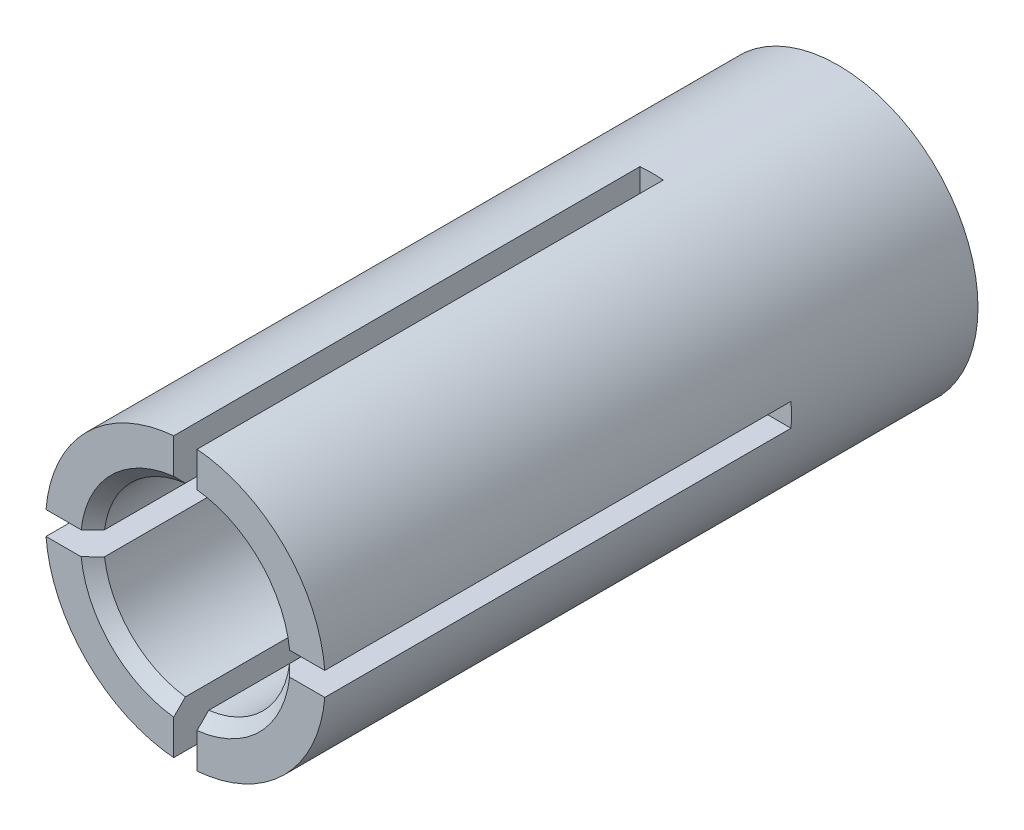
ISO-10303-21;
HEADER;
FILE_DESCRIPTION(('STEP AP214'),'2;1');
FILE_NAME('part.step','',(''),(''),'','','');
FILE_SCHEMA(('AUTOMOTIVE_DESIGN { 1 0 10303 214 1 1 1 1 }'));
ENDSEC;
DATA;
#1=APPLICATION_CONTEXT('core data for automotive mechanical design processes');
#2=APPLICATION_PROTOCOL_DEFINITION('international standard','automotive_design',2000,#1);
#3=PRODUCT_CONTEXT('',#1,'mechanical');
#4=PRODUCT('Part','Part','',(#3));
#5=PRODUCT_RELATED_PRODUCT_CATEGORY('part','',(#4));
#6=PRODUCT_DEFINITION_FORMATION('','',#4);
#7=PRODUCT_DEFINITION_CONTEXT('part definition',#1,'design');
#8=PRODUCT_DEFINITION('design','',#6,#7);
#9=PRODUCT_DEFINITION_SHAPE('','',#8);
#10=(LENGTH_UNIT() NAMED_UNIT(*) SI_UNIT(.MILLI.,.METRE.));
#11=(NAMED_UNIT(*) PLANE_ANGLE_UNIT() SI_UNIT($,.RADIAN.));
#12=(NAMED_UNIT(*) SI_UNIT($,.STERADIAN.) SOLID_ANGLE_UNIT());
#13=UNCERTAINTY_MEASURE_WITH_UNIT(LENGTH_MEASURE(1.E-05),#10,'distance_accuracy_value','');
#14=(GEOMETRIC_REPRESENTATION_CONTEXT(3) GLOBAL_UNCERTAINTY_ASSIGNED_CONTEXT((#13)) GLOBAL_UNIT_ASSIGNED_CONTEXT((#10,
#11,#12)) REPRESENTATION_CONTEXT('',''));
#15=CARTESIAN_POINT('',(0.,0.,0.));
#16=DIRECTION('',(0.,0.,1.));
#17=DIRECTION('',(1.,0.,0.));
#18=AXIS2_PLACEMENT_3D('',#15,#16,#17);
#19=CARTESIAN_POINT('',(0.,0.,14.));
#20=DIRECTION('',(0.,0.,1.));
#21=DIRECTION('',(1.,0.,0.));
#22=AXIS2_PLACEMENT_3D('',#19,#20,#21);
#23=PLANE('',#22);
#24=DIRECTION('',(1.,0.,0.));
#25=VECTOR('',#24,1.);
#26=CARTESIAN_POINT('',(2.98956518577535,-0.25,14.));
#27=LINE('',#26,#25);
#28=CARTESIAN_POINT('',(2.23606797749979,-0.25,14.));
#29=VERTEX_POINT('',#28);
#30=CARTESIAN_POINT('',(2.98956518577535,-0.25,14.));
#31=VERTEX_POINT('',#30);
#32=EDGE_CURVE('E189',#29,#31,#27,.T.);
#33=ORIENTED_EDGE('',*,*,#32,.F.);
#34=CARTESIAN_POINT('',(0.,0.,14.));
#35=DIRECTION('',(0.,0.,1.));
#36=DIRECTION('',(1.,0.,0.));
#37=AXIS2_PLACEMENT_3D('',#34,#35,#36);
#38=CIRCLE('',#37,2.25);
#39=CARTESIAN_POINT('',(0.25,-2.23606797749979,14.));
#40=VERTEX_POINT('',#39);
#41=EDGE_CURVE('E235',#29,#40,#38,.F.);
#42=ORIENTED_EDGE('',*,*,#41,.T.);
#43=DIRECTION('',(0.,1.,0.));
#44=VECTOR('',#43,1.);
#45=CARTESIAN_POINT('',(0.25,-0.25,14.));
#46=LINE('',#45,#44);
#47=CARTESIAN_POINT('',(0.250000000000002,-2.98956518577535,14.));
#48=VERTEX_POINT('',#47);
#49=EDGE_CURVE('E287',#48,#40,#46,.T.);
#50=ORIENTED_EDGE('',*,*,#49,.F.);
#51=CARTESIAN_POINT('',(0.,0.,14.));
#52=DIRECTION('',(0.,0.,1.));
#53=DIRECTION('',(1.,0.,0.));
#54=AXIS2_PLACEMENT_3D('',#51,#52,#53);
#55=CIRCLE('',#54,3.);
#56=EDGE_CURVE('E227',#48,#31,#55,.T.);
#57=ORIENTED_EDGE('',*,*,#56,.T.);
#58=EDGE_LOOP('',(#33,#42,#50,#57));
#59=FACE_BOUND('',#58,.T.);
#60=ADVANCED_FACE('F30',(#59),#23,.T.);
#61=DIRECTION('',(0.,-1.,0.));
#62=VECTOR('',#61,1.);
#63=CARTESIAN_POINT('',(-0.25,-0.25,14.));
#64=LINE('',#63,#62);
#65=CARTESIAN_POINT('',(-0.25,-2.23606797749979,14.));
#66=VERTEX_POINT('',#65);
#67=CARTESIAN_POINT('',(-0.25,-2.98956518577535,14.));
#68=VERTEX_POINT('',#67);
#69=EDGE_CURVE('E394',#66,#68,#64,.T.);
#70=ORIENTED_EDGE('',*,*,#69,.F.);
#71=CARTESIAN_POINT('',(-2.23606797749979,-0.25,14.));
#72=VERTEX_POINT('',#71);
#73=EDGE_CURVE('E239',#66,#72,#38,.F.);
#74=ORIENTED_EDGE('',*,*,#73,.T.);
#75=DIRECTION('',(1.,0.,0.));
#76=VECTOR('',#75,1.);
#77=CARTESIAN_POINT('',(-2.98956518577535,-0.25,14.));
#78=LINE('',#77,#76);
#79=CARTESIAN_POINT('',(-2.98956518577535,-0.249999999999999,14.));
#80=VERTEX_POINT('',#79);
#81=EDGE_CURVE('E392',#80,#72,#78,.T.);
#82=ORIENTED_EDGE('',*,*,#81,.F.);
#83=EDGE_CURVE('E434',#80,#68,#55,.T.);
#84=ORIENTED_EDGE('',*,*,#83,.T.);
#85=EDGE_LOOP('',(#70,#74,#82,#84));
#86=FACE_BOUND('',#85,.T.);
#87=ADVANCED_FACE('F275',(#86),#23,.T.);
#88=DIRECTION('',(-1.,0.,0.));
#89=VECTOR('',#88,1.);
#90=CARTESIAN_POINT('',(-2.98956518577535,0.249999999999998,14.));
#91=LINE('',#90,#89);
#92=CARTESIAN_POINT('',(-2.23606797749979,0.249999999999999,14.));
#93=VERTEX_POINT('',#92);
#94=CARTESIAN_POINT('',(-2.98956518577535,0.249999999999998,14.));
#95=VERTEX_POINT('',#94);
#96=EDGE_CURVE('E412',#93,#95,#91,.T.);
#97=ORIENTED_EDGE('',*,*,#96,.F.);
#98=CARTESIAN_POINT('',(-0.25,2.23606797749979,14.));
#99=VERTEX_POINT('',#98);
#100=EDGE_CURVE('E381',#93,#99,#38,.F.);
#101=ORIENTED_EDGE('',*,*,#100,.T.);
#102=DIRECTION('',(0.,-1.,0.));
#103=VECTOR('',#102,1.);
#104=CARTESIAN_POINT('',(-0.25,0.25,14.));
#105=LINE('',#104,#103);
#106=CARTESIAN_POINT('',(-0.25,2.98956518577535,14.));
#107=VERTEX_POINT('',#106);
#108=EDGE_CURVE('E415',#107,#99,#105,.T.);
#109=ORIENTED_EDGE('',*,*,#108,.F.);
#110=EDGE_CURVE('E226',#107,#95,#55,.T.);
#111=ORIENTED_EDGE('',*,*,#110,.T.);
#112=EDGE_LOOP('',(#97,#101,#109,#111));
#113=FACE_BOUND('',#112,.T.);
#114=ADVANCED_FACE('F268',(#113),#23,.T.);
#115=CARTESIAN_POINT('',(0.,0.,13.75));
#116=DIRECTION('',(0.,0.,1.));
#117=DIRECTION('',(1.,0.,0.));
#118=AXIS2_PLACEMENT_3D('',#115,#116,#117);
#119=CONICAL_SURFACE('',#118,2.,0.785398163397455);
#120=CARTESIAN_POINT('',(0.302741084224424,-0.25,12.1426221645264));
#121=CARTESIAN_POINT('',(0.317960453729847,-0.25,12.1543679730482));
#122=CARTESIAN_POINT('',(0.333014531848367,-0.25,12.1663229463904));
#123=CARTESIAN_POINT('',(0.36285792672978,-0.25,12.190554220147));
#124=CARTESIAN_POINT('',(0.377647290102898,-0.25,12.2028304630369));
#125=CARTESIAN_POINT('',(0.421711584192529,-0.25,12.2399907180696));
#126=CARTESIAN_POINT('',(0.450696505860515,-0.25,12.2652171671053));
#127=CARTESIAN_POINT('',(0.508176291730957,-0.25,12.3161879557759));
#128=CARTESIAN_POINT('',(0.536671402315201,-0.25,12.3419320200088));
#129=CARTESIAN_POINT('',(0.593351685196753,-0.25,12.3937670443241));
#130=CARTESIAN_POINT('',(0.621536809723744,-0.25,12.4198580565411));
#131=CARTESIAN_POINT('',(0.70945296388415,-0.25,12.5018997394878));
#132=CARTESIAN_POINT('',(0.768811177280418,-0.25,12.5582489591398));
#133=CARTESIAN_POINT('',(0.887045822918402,-0.25,12.6714511318724));
#134=CARTESIAN_POINT('',(0.945922240026668,-0.25,12.72830410066));
#135=CARTESIAN_POINT('',(1.12213731279967,-0.25,12.8992872007103));
#136=CARTESIAN_POINT('',(1.23906296186066,-0.25,13.013842641041));
#137=CARTESIAN_POINT('',(1.47257646545155,-0.25,13.2435090676362));
#138=CARTESIAN_POINT('',(1.58916391117353,-0.25,13.3586204674635));
#139=CARTESIAN_POINT('',(1.82209400881993,-0.25,13.5890861029974));
#140=CARTESIAN_POINT('',(1.9384366657381,-0.25,13.7044403336521));
#141=CARTESIAN_POINT('',(2.19822193413989,-0.25,13.9623251721432));
#142=CARTESIAN_POINT('',(2.34162858752974,-0.25,14.104891962737));
#143=CARTESIAN_POINT('',(2.62832290392371,-0.25,14.3901473591601));
#144=CARTESIAN_POINT('',(2.77161056599507,-0.25,14.5328359659267));
#145=CARTESIAN_POINT('',(3.05792402957366,-0.25,14.8181018736583));
#146=CARTESIAN_POINT('',(3.20094992869957,-0.25,14.9606790766729));
#147=CARTESIAN_POINT('',(3.48694883303794,-0.25,15.2458841152313));
#148=CARTESIAN_POINT('',(3.6299218386862,-0.25,15.3885119503382));
#149=CARTESIAN_POINT('',(3.77288046266891,-0.25,15.5311541869631));
#150=B_SPLINE_CURVE_WITH_KNOTS('',3,(#120,#121,#122,#123,#124,#125,#126,#127,#128,#129,#130,
#131,#132,#133,#134,#135,#136,#137,#138,#139,#140,#141,#142,#143,#144,#145,#146,#147,#148,#149),
.UNSPECIFIED.,.F.,.F.,(4,2,2,2,2,2,2,2,2,2,2,2,2,2,4),(0.,0.057668137817235,0.115326019670359,
0.23058906804333,0.345792332639199,0.461013108618342,0.706541151172433,0.952076876502175,
1.44314347376522,1.93466102702139,2.42616845403975,3.03281229507879,3.63946084754578,
4.24531725391537,4.85116855206024),.UNSPECIFIED.);
#151=CARTESIAN_POINT('',(1.98431348329844,-0.25,13.75));
#152=VERTEX_POINT('',#151);
#153=EDGE_CURVE('E294',#152,#29,#150,.T.);
#154=ORIENTED_EDGE('',*,*,#153,.F.);
#155=CARTESIAN_POINT('',(0.,0.,13.75));
#156=DIRECTION('',(0.,0.,1.));
#157=DIRECTION('',(1.,0.,0.));
#158=AXIS2_PLACEMENT_3D('',#155,#156,#157);
#159=CIRCLE('',#158,2.);
#160=CARTESIAN_POINT('',(0.25,-1.98431348329844,13.75));
#161=VERTEX_POINT('',#160);
#162=EDGE_CURVE('E225',#161,#152,#159,.T.);
#163=ORIENTED_EDGE('',*,*,#162,.F.);
#164=CARTESIAN_POINT('',(0.25,-3.77288046266891,15.5311541869631));
#165=CARTESIAN_POINT('',(0.25,-3.62981802243947,15.3884085007871));
#166=CARTESIAN_POINT('',(0.25,-3.48674127796846,15.245677131242));
#167=CARTESIAN_POINT('',(0.25,-3.20054113992748,14.9602714322271));
#168=CARTESIAN_POINT('',(0.25,-3.05741774821332,14.8175971008963));
#169=CARTESIAN_POINT('',(0.25,-2.77111016330189,14.5323377376306));
#170=CARTESIAN_POINT('',(0.25,-2.62792597750641,14.3897526982675));
#171=CARTESIAN_POINT('',(0.25,-2.34143336691177,14.1046974507362));
#172=CARTESIAN_POINT('',(0.25,-2.19812493795967,13.9622272467398));
#173=CARTESIAN_POINT('',(0.25,-1.98298880509478,13.7486673764058));
#174=CARTESIAN_POINT('',(0.25,-1.91124050811756,13.6774977298582));
#175=CARTESIAN_POINT('',(0.25,-1.76767011833127,13.5352348752943));
#176=CARTESIAN_POINT('',(0.25,-1.69584802655194,13.464141666239));
#177=CARTESIAN_POINT('',(0.25,-1.55210436650431,13.3220711612731));
#178=CARTESIAN_POINT('',(0.25,-1.48018280965929,13.2510938538114));
#179=CARTESIAN_POINT('',(0.25,-1.33617309257203,13.1093013228982));
#180=CARTESIAN_POINT('',(0.25,-1.2640849242968,13.0384861076038));
#181=CARTESIAN_POINT('',(0.25,-1.11962163137609,12.8970953300996));
#182=CARTESIAN_POINT('',(0.25,-1.04724641128778,12.8265198651804));
#183=CARTESIAN_POINT('',(0.25,-0.938335808618407,12.7210277003167));
#184=CARTESIAN_POINT('',(0.25,-0.90197738080137,12.6859284166719));
#185=CARTESIAN_POINT('',(0.25,-0.829090459358274,12.6159028370612));
#186=CARTESIAN_POINT('',(0.25,-0.792561957067124,12.5809765501007));
#187=CARTESIAN_POINT('',(0.25,-0.719238707395647,12.5113617459312));
#188=CARTESIAN_POINT('',(0.25,-0.682443818330706,12.4766733778196));
#189=CARTESIAN_POINT('',(0.25,-0.608484016046663,12.4077018126905));
#190=CARTESIAN_POINT('',(0.25,-0.57131915658067,12.3734185583522));
#191=CARTESIAN_POINT('',(0.25,-0.51508999379516,12.3224993377492));
#192=CARTESIAN_POINT('',(0.25,-0.496260183651158,12.3056049183895));
#193=CARTESIAN_POINT('',(0.25,-0.458389334451682,12.2720572281331));
#194=CARTESIAN_POINT('',(0.25,-0.439348311762073,12.2554039387796));
#195=CARTESIAN_POINT('',(0.25,-0.400970972219268,12.2224183848648));
#196=CARTESIAN_POINT('',(0.25,-0.381634510005532,12.206086288006));
#197=CARTESIAN_POINT('',(0.25,-0.342537743825695,12.1739281736697));
#198=CARTESIAN_POINT('',(0.25,-0.32277732694518,12.1581022938832));
#199=CARTESIAN_POINT('',(0.25,-0.302741084224424,12.1426221645264));
#200=B_SPLINE_CURVE_WITH_KNOTS('',3,(#164,#165,#166,#167,#168,#169,#170,#171,#172,#173,#174,
#175,#176,#177,#178,#179,#180,#181,#182,#183,#184,#185,#186,#187,#188,#189,#190,#191,#192,#193,
#194,#195,#196,#197,#198,#199),.UNSPECIFIED.,.F.,.F.,(4,2,2,2,2,2,2,2,2,2,2,2,2,2,2,2,2,4),(0.,
0.606290986171906,1.21256024144211,1.81876961421285,2.42500009807164,2.72817728399238,
3.03135029532569,3.33449098070736,3.63764660000146,3.94091326932693,4.09252113778145,
4.24413681689769,4.39584012888943,4.5475217125328,4.62341380562543,4.69930005871457,
4.77522493487536,4.85117028995729),.UNSPECIFIED.);
#201=EDGE_CURVE('E296',#40,#161,#200,.T.);
#202=ORIENTED_EDGE('',*,*,#201,.F.);
#203=ORIENTED_EDGE('',*,*,#41,.F.);
#204=EDGE_LOOP('',(#154,#163,#202,#203));
#205=FACE_BOUND('',#204,.T.);
#206=ADVANCED_FACE('F292',(#205),#119,.F.);
#207=CARTESIAN_POINT('',(-0.25,-0.302741084224424,12.1426221645264));
#208=CARTESIAN_POINT('',(-0.25,-0.317960453729848,12.1543679730482));
#209=CARTESIAN_POINT('',(-0.25,-0.333014531848367,12.1663229463904));
#210=CARTESIAN_POINT('',(-0.25,-0.362857926729781,12.190554220147));
#211=CARTESIAN_POINT('',(-0.25,-0.377647290102899,12.2028304630369));
#212=CARTESIAN_POINT('',(-0.25,-0.42171158419253,12.2399907180696));
#213=CARTESIAN_POINT('',(-0.25,-0.450696505860516,12.2652171671053));
#214=CARTESIAN_POINT('',(-0.25,-0.508176291730958,12.3161879557759));
#215=CARTESIAN_POINT('',(-0.25,-0.536671402315201,12.3419320200088));
#216=CARTESIAN_POINT('',(-0.25,-0.593351685196753,12.3937670443241));
#217=CARTESIAN_POINT('',(-0.25,-0.621536809723744,12.4198580565411));
#218=CARTESIAN_POINT('',(-0.25,-0.70945296388415,12.5018997394878));
#219=CARTESIAN_POINT('',(-0.25,-0.768811177280418,12.5582489591398));
#220=CARTESIAN_POINT('',(-0.25,-0.887045822918402,12.6714511318724));
#221=CARTESIAN_POINT('',(-0.25,-0.945922240026668,12.72830410066));
#222=CARTESIAN_POINT('',(-0.25,-1.12213731279967,12.8992872007103));
#223=CARTESIAN_POINT('',(-0.25,-1.23906296186066,13.013842641041));
#224=CARTESIAN_POINT('',(-0.25,-1.47257646545154,13.2435090676362));
#225=CARTESIAN_POINT('',(-0.25,-1.58916391117353,13.3586204674635));
#226=CARTESIAN_POINT('',(-0.25,-1.82209400881993,13.5890861029974));
#227=CARTESIAN_POINT('',(-0.25,-1.9384366657381,13.7044403336521));
#228=CARTESIAN_POINT('',(-0.25,-2.19822193413989,13.9623251721432));
#229=CARTESIAN_POINT('',(-0.25,-2.34162858752974,14.104891962737));
#230=CARTESIAN_POINT('',(-0.25,-2.62832290392371,14.3901473591601));
#231=CARTESIAN_POINT('',(-0.25,-2.77161056599507,14.5328359659267));
#232=CARTESIAN_POINT('',(-0.25,-3.05792402957366,14.8181018736583));
#233=CARTESIAN_POINT('',(-0.25,-3.20094992869957,14.9606790766729));
#234=CARTESIAN_POINT('',(-0.25,-3.48694883303794,15.2458841152313));
#235=CARTESIAN_POINT('',(-0.25,-3.6299218386862,15.3885119503382));
#236=CARTESIAN_POINT('',(-0.25,-3.77288046266891,15.5311541869631));
#237=B_SPLINE_CURVE_WITH_KNOTS('',3,(#207,#208,#209,#210,#211,#212,#213,#214,#215,#216,#217,
#218,#219,#220,#221,#222,#223,#224,#225,#226,#227,#228,#229,#230,#231,#232,#233,#234,#235,#236),
.UNSPECIFIED.,.F.,.F.,(4,2,2,2,2,2,2,2,2,2,2,2,2,2,4),(0.,0.0576681378172352,0.115326019670361,
0.23058906804333,0.345792332639199,0.461013108618341,0.706541151172433,0.952076876502175,
1.44314347376522,1.93466102702138,2.42616845403975,3.03281229507879,3.63946084754578,
4.24531725391537,4.85116855206024),.UNSPECIFIED.);
#238=CARTESIAN_POINT('',(-0.25,-1.98431348329844,13.75));
#239=VERTEX_POINT('',#238);
#240=EDGE_CURVE('E299',#239,#66,#237,.T.);
#241=ORIENTED_EDGE('',*,*,#240,.F.);
#242=CARTESIAN_POINT('',(-1.98431348329844,-0.25,13.75));
#243=VERTEX_POINT('',#242);
#244=EDGE_CURVE('E400',#243,#239,#159,.T.);
#245=ORIENTED_EDGE('',*,*,#244,.F.);
#246=CARTESIAN_POINT('',(-3.77288046266891,-0.25,15.5311541869631));
#247=CARTESIAN_POINT('',(-3.62981802243947,-0.25,15.3884085007871));
#248=CARTESIAN_POINT('',(-3.48674127796846,-0.25,15.245677131242));
#249=CARTESIAN_POINT('',(-3.20054113992748,-0.25,14.9602714322271));
#250=CARTESIAN_POINT('',(-3.05741774821332,-0.25,14.8175971008962));
#251=CARTESIAN_POINT('',(-2.77111016330189,-0.25,14.5323377376306));
#252=CARTESIAN_POINT('',(-2.6279259775064,-0.25,14.3897526982675));
#253=CARTESIAN_POINT('',(-2.34143336691176,-0.25,14.1046974507362));
#254=CARTESIAN_POINT('',(-2.19812493795967,-0.25,13.9622272467398));
#255=CARTESIAN_POINT('',(-1.98298880509478,-0.25,13.7486673764058));
#256=CARTESIAN_POINT('',(-1.91124050811756,-0.25,13.6774977298582));
#257=CARTESIAN_POINT('',(-1.76767011833127,-0.25,13.5352348752943));
#258=CARTESIAN_POINT('',(-1.69584802655194,-0.25,13.464141666239));
#259=CARTESIAN_POINT('',(-1.55210436650431,-0.25,13.3220711612731));
#260=CARTESIAN_POINT('',(-1.48018280965929,-0.25,13.2510938538114));
#261=CARTESIAN_POINT('',(-1.33617309257203,-0.25,13.1093013228982));
#262=CARTESIAN_POINT('',(-1.2640849242968,-0.25,13.0384861076038));
#263=CARTESIAN_POINT('',(-1.11962163137609,-0.25,12.8970953300996));
#264=CARTESIAN_POINT('',(-1.04724641128778,-0.25,12.8265198651804));
#265=CARTESIAN_POINT('',(-0.938335808618407,-0.25,12.7210277003167));
#266=CARTESIAN_POINT('',(-0.901977380801369,-0.25,12.6859284166719));
#267=CARTESIAN_POINT('',(-0.829090459358274,-0.25,12.6159028370612));
#268=CARTESIAN_POINT('',(-0.792561957067124,-0.25,12.5809765501007));
#269=CARTESIAN_POINT('',(-0.719238707395648,-0.25,12.5113617459312));
#270=CARTESIAN_POINT('',(-0.682443818330707,-0.25,12.4766733778196));
#271=CARTESIAN_POINT('',(-0.608484016046665,-0.25,12.4077018126905));
#272=CARTESIAN_POINT('',(-0.571319156580671,-0.25,12.3734185583522));
#273=CARTESIAN_POINT('',(-0.515089993795162,-0.25,12.3224993377492));
#274=CARTESIAN_POINT('',(-0.496260183651158,-0.25,12.3056049183895));
#275=CARTESIAN_POINT('',(-0.458389334451683,-0.25,12.2720572281331));
#276=CARTESIAN_POINT('',(-0.439348311762074,-0.25,12.2554039387796));
#277=CARTESIAN_POINT('',(-0.40097097221927,-0.25,12.2224183848648));
#278=CARTESIAN_POINT('',(-0.381634510005534,-0.25,12.2060862880061));
#279=CARTESIAN_POINT('',(-0.342537743825697,-0.25,12.1739281736697));
#280=CARTESIAN_POINT('',(-0.322777326945181,-0.25,12.1581022938832));
#281=CARTESIAN_POINT('',(-0.302741084224424,-0.25,12.1426221645264));
#282=B_SPLINE_CURVE_WITH_KNOTS('',3,(#246,#247,#248,#249,#250,#251,#252,#253,#254,#255,#256,
#257,#258,#259,#260,#261,#262,#263,#264,#265,#266,#267,#268,#269,#270,#271,#272,#273,#274,#275,
#276,#277,#278,#279,#280,#281),.UNSPECIFIED.,.F.,.F.,(4,2,2,2,2,2,2,2,2,2,2,2,2,2,2,2,2,4),(0.,
0.606290986171907,1.21256024144211,1.81876961421285,2.42500009807164,2.72817728399238,
3.03135029532568,3.33449098070736,3.63764660000146,3.94091326932692,4.09252113778145,
4.24413681689769,4.39584012888943,4.54752171253279,4.62341380562543,4.69930005871457,
4.77522493487535,4.85117028995728),.UNSPECIFIED.);
#283=EDGE_CURVE('E301',#72,#243,#282,.T.);
#284=ORIENTED_EDGE('',*,*,#283,.F.);
#285=ORIENTED_EDGE('',*,*,#73,.F.);
#286=EDGE_LOOP('',(#241,#245,#284,#285));
#287=FACE_BOUND('',#286,.T.);
#288=ADVANCED_FACE('F397',(#287),#119,.F.);
#289=CARTESIAN_POINT('',(-0.302741084224424,0.25,12.1426221645264));
#290=CARTESIAN_POINT('',(-0.317960453729848,0.25,12.1543679730482));
#291=CARTESIAN_POINT('',(-0.333014531848368,0.25,12.1663229463904));
#292=CARTESIAN_POINT('',(-0.362857926729781,0.25,12.190554220147));
#293=CARTESIAN_POINT('',(-0.3776472901029,0.25,12.2028304630369));
#294=CARTESIAN_POINT('',(-0.42171158419253,0.25,12.2399907180696));
#295=CARTESIAN_POINT('',(-0.450696505860517,0.25,12.2652171671053));
#296=CARTESIAN_POINT('',(-0.508176291730959,0.25,12.3161879557759));
#297=CARTESIAN_POINT('',(-0.536671402315202,0.25,12.3419320200088));
#298=CARTESIAN_POINT('',(-0.593351685196754,0.25,12.3937670443241));
#299=CARTESIAN_POINT('',(-0.621536809723745,0.25,12.4198580565411));
#300=CARTESIAN_POINT('',(-0.709452963884151,0.25,12.5018997394878));
#301=CARTESIAN_POINT('',(-0.768811177280419,0.25,12.5582489591398));
#302=CARTESIAN_POINT('',(-0.887045822918403,0.249999999999999,12.6714511318724));
#303=CARTESIAN_POINT('',(-0.945922240026669,0.249999999999999,12.72830410066));
#304=CARTESIAN_POINT('',(-1.12213731279967,0.249999999999999,12.8992872007103));
#305=CARTESIAN_POINT('',(-1.23906296186066,0.249999999999999,13.013842641041));
#306=CARTESIAN_POINT('',(-1.47257646545154,0.249999999999999,13.2435090676362));
#307=CARTESIAN_POINT('',(-1.58916391117353,0.249999999999999,13.3586204674635));
#308=CARTESIAN_POINT('',(-1.82209400881993,0.249999999999999,13.5890861029974));
#309=CARTESIAN_POINT('',(-1.9384366657381,0.249999999999999,13.7044403336521));
#310=CARTESIAN_POINT('',(-2.19822193413988,0.249999999999999,13.9623251721432));
#311=CARTESIAN_POINT('',(-2.34162858752973,0.249999999999999,14.104891962737));
#312=CARTESIAN_POINT('',(-2.62832290392371,0.249999999999998,14.3901473591601));
#313=CARTESIAN_POINT('',(-2.77161056599507,0.249999999999998,14.5328359659267));
#314=CARTESIAN_POINT('',(-3.05792402957366,0.249999999999998,14.8181018736583));
#315=CARTESIAN_POINT('',(-3.20094992869957,0.249999999999998,14.9606790766729));
#316=CARTESIAN_POINT('',(-3.48694883303793,0.249999999999998,15.2458841152313));
#317=CARTESIAN_POINT('',(-3.6299218386862,0.249999999999998,15.3885119503382));
#318=CARTESIAN_POINT('',(-3.77288046266891,0.249999999999998,15.5311541869631));
#319=B_SPLINE_CURVE_WITH_KNOTS('',3,(#289,#290,#291,#292,#293,#294,#295,#296,#297,#298,#299,
#300,#301,#302,#303,#304,#305,#306,#307,#308,#309,#310,#311,#312,#313,#314,#315,#316,#317,#318),
.UNSPECIFIED.,.F.,.F.,(4,2,2,2,2,2,2,2,2,2,2,2,2,2,4),(0.,0.0576681378172349,0.115326019670361,
0.230589068043331,0.345792332639199,0.461013108618343,0.706541151172433,0.952076876502175,
1.44314347376522,1.93466102702138,2.42616845403975,3.03281229507879,3.63946084754578,
4.24531725391537,4.85116855206023),.UNSPECIFIED.);
#320=CARTESIAN_POINT('',(-1.98431348329844,0.249999999999999,13.75));
#321=VERTEX_POINT('',#320);
#322=EDGE_CURVE('E338',#321,#93,#319,.T.);
#323=ORIENTED_EDGE('',*,*,#322,.F.);
#324=CARTESIAN_POINT('',(-0.25,1.98431348329844,13.75));
#325=VERTEX_POINT('',#324);
#326=EDGE_CURVE('E234',#325,#321,#159,.T.);
#327=ORIENTED_EDGE('',*,*,#326,.F.);
#328=CARTESIAN_POINT('',(-0.25,3.77288046266891,15.5311541869631));
#329=CARTESIAN_POINT('',(-0.25,3.62981802243947,15.3884085007871));
#330=CARTESIAN_POINT('',(-0.25,3.48674127796846,15.245677131242));
#331=CARTESIAN_POINT('',(-0.25,3.20054113992748,14.9602714322271));
#332=CARTESIAN_POINT('',(-0.25,3.05741774821332,14.8175971008962));
#333=CARTESIAN_POINT('',(-0.25,2.77111016330189,14.5323377376306));
#334=CARTESIAN_POINT('',(-0.25,2.6279259775064,14.3897526982675));
#335=CARTESIAN_POINT('',(-0.25,2.34143336691176,14.1046974507362));
#336=CARTESIAN_POINT('',(-0.25,2.19812493795967,13.9622272467398));
#337=CARTESIAN_POINT('',(-0.25,1.98298880509478,13.7486673764058));
#338=CARTESIAN_POINT('',(-0.25,1.91124050811756,13.6774977298582));
#339=CARTESIAN_POINT('',(-0.25,1.76767011833127,13.5352348752943));
#340=CARTESIAN_POINT('',(-0.25,1.69584802655194,13.464141666239));
#341=CARTESIAN_POINT('',(-0.25,1.55210436650431,13.3220711612731));
#342=CARTESIAN_POINT('',(-0.25,1.48018280965929,13.2510938538114));
#343=CARTESIAN_POINT('',(-0.25,1.33617309257203,13.1093013228982));
#344=CARTESIAN_POINT('',(-0.25,1.2640849242968,13.0384861076038));
#345=CARTESIAN_POINT('',(-0.25,1.11962163137609,12.8970953300996));
#346=CARTESIAN_POINT('',(-0.25,1.04724641128778,12.8265198651804));
#347=CARTESIAN_POINT('',(-0.25,0.938335808618407,12.7210277003167));
#348=CARTESIAN_POINT('',(-0.25,0.901977380801369,12.6859284166719));
#349=CARTESIAN_POINT('',(-0.25,0.829090459358274,12.6159028370612));
#350=CARTESIAN_POINT('',(-0.25,0.792561957067124,12.5809765501007));
#351=CARTESIAN_POINT('',(-0.25,0.719238707395648,12.5113617459312));
#352=CARTESIAN_POINT('',(-0.25,0.682443818330707,12.4766733778196));
#353=CARTESIAN_POINT('',(-0.25,0.608484016046665,12.4077018126905));
#354=CARTESIAN_POINT('',(-0.25,0.571319156580672,12.3734185583522));
#355=CARTESIAN_POINT('',(-0.25,0.515089993795162,12.3224993377492));
#356=CARTESIAN_POINT('',(-0.25,0.496260183651158,12.3056049183895));
#357=CARTESIAN_POINT('',(-0.25,0.458389334451682,12.2720572281331));
#358=CARTESIAN_POINT('',(-0.25,0.439348311762074,12.2554039387796));
#359=CARTESIAN_POINT('',(-0.25,0.40097097221927,12.2224183848648));
#360=CARTESIAN_POINT('',(-0.25,0.381634510005534,12.2060862880061));
#361=CARTESIAN_POINT('',(-0.25,0.342537743825697,12.1739281736697));
#362=CARTESIAN_POINT('',(-0.25,0.322777326945181,12.1581022938832));
#363=CARTESIAN_POINT('',(-0.25,0.302741084224424,12.1426221645264));
#364=B_SPLINE_CURVE_WITH_KNOTS('',3,(#328,#329,#330,#331,#332,#333,#334,#335,#336,#337,#338,
#339,#340,#341,#342,#343,#344,#345,#346,#347,#348,#349,#350,#351,#352,#353,#354,#355,#356,#357,
#358,#359,#360,#361,#362,#363),.UNSPECIFIED.,.F.,.F.,(4,2,2,2,2,2,2,2,2,2,2,2,2,2,2,2,2,4),(0.,
0.606290986171907,1.21256024144211,1.81876961421285,2.42500009807164,2.72817728399238,
3.03135029532568,3.33449098070736,3.63764660000146,3.94091326932692,4.09252113778145,
4.24413681689769,4.39584012888943,4.54752171253279,4.62341380562542,4.69930005871457,
4.77522493487536,4.85117028995728),.UNSPECIFIED.);
#365=EDGE_CURVE('E342',#99,#325,#364,.T.);
#366=ORIENTED_EDGE('',*,*,#365,.F.);
#367=ORIENTED_EDGE('',*,*,#100,.F.);
#368=EDGE_LOOP('',(#323,#327,#366,#367));
#369=FACE_BOUND('',#368,.T.);
#370=ADVANCED_FACE('F266',(#369),#119,.F.);
#371=DIRECTION('',(0.,1.,0.));
#372=VECTOR('',#371,1.);
#373=CARTESIAN_POINT('',(0.25,2.98956518577535,14.));
#374=LINE('',#373,#372);
#375=CARTESIAN_POINT('',(0.25,2.23606797749979,14.));
#376=VERTEX_POINT('',#375);
#377=CARTESIAN_POINT('',(0.25,2.98956518577535,14.));
#378=VERTEX_POINT('',#377);
#379=EDGE_CURVE('E418',#376,#378,#374,.T.);
#380=ORIENTED_EDGE('',*,*,#379,.F.);
#381=CARTESIAN_POINT('',(2.23606797749979,0.25,14.));
#382=VERTEX_POINT('',#381);
#383=EDGE_CURVE('E233',#376,#382,#38,.F.);
#384=ORIENTED_EDGE('',*,*,#383,.T.);
#385=DIRECTION('',(-1.,0.,0.));
#386=VECTOR('',#385,1.);
#387=CARTESIAN_POINT('',(0.25,0.25,14.));
#388=LINE('',#387,#386);
#389=CARTESIAN_POINT('',(2.98956518577535,0.25,14.));
#390=VERTEX_POINT('',#389);
#391=EDGE_CURVE('E450',#390,#382,#388,.T.);
#392=ORIENTED_EDGE('',*,*,#391,.F.);
#393=EDGE_CURVE('E197',#390,#378,#55,.T.);
#394=ORIENTED_EDGE('',*,*,#393,.T.);
#395=EDGE_LOOP('',(#380,#384,#392,#394));
#396=FACE_BOUND('',#395,.T.);
#397=ADVANCED_FACE('F262',(#396),#23,.T.);
#398=CARTESIAN_POINT('',(0.,0.,0.));
#399=DIRECTION('',(0.,0.,1.));
#400=DIRECTION('',(1.,0.,0.));
#401=AXIS2_PLACEMENT_3D('',#398,#399,#400);
#402=PLANE('',#401);
#403=CARTESIAN_POINT('',(0.,0.,0.));
#404=DIRECTION('',(0.,0.,1.));
#405=DIRECTION('',(1.,0.,0.));
#406=AXIS2_PLACEMENT_3D('',#403,#404,#405);
#407=CIRCLE('',#406,3.);
#408=CARTESIAN_POINT('',(3.,0.,0.));
#409=VERTEX_POINT('',#408);
#410=EDGE_CURVE('E223',#409,#409,#407,.T.);
#411=ORIENTED_EDGE('',*,*,#410,.F.);
#412=EDGE_LOOP('',(#411));
#413=FACE_BOUND('',#412,.T.);
#414=CARTESIAN_POINT('',(0.,0.,0.));
#415=DIRECTION('',(0.,0.,1.));
#416=DIRECTION('',(1.,0.,0.));
#417=AXIS2_PLACEMENT_3D('',#414,#415,#416);
#418=CIRCLE('',#417,2.);
#419=CARTESIAN_POINT('',(2.,0.,0.));
#420=VERTEX_POINT('',#419);
#421=EDGE_CURVE('E220',#420,#420,#418,.T.);
#422=ORIENTED_EDGE('',*,*,#421,.T.);
#423=EDGE_LOOP('',(#422));
#424=FACE_BOUND('',#423,.T.);
#425=ADVANCED_FACE('F265',(#413,#424),#402,.F.);
#426=CARTESIAN_POINT('',(0.,0.,14.));
#427=DIRECTION('',(0.,0.,-1.));
#428=DIRECTION('',(-1.,0.,0.));
#429=AXIS2_PLACEMENT_3D('',#426,#427,#428);
#430=CYLINDRICAL_SURFACE('',#429,3.);
#431=ORIENTED_EDGE('',*,*,#110,.F.);
#432=DIRECTION('',(0.,0.,1.));
#433=VECTOR('',#432,1.);
#434=CARTESIAN_POINT('',(-0.25,2.98956518577535,4.));
#435=LINE('',#434,#433);
#436=CARTESIAN_POINT('',(-0.25,2.98956518577535,4.));
#437=VERTEX_POINT('',#436);
#438=EDGE_CURVE('E200',#437,#107,#435,.T.);
#439=ORIENTED_EDGE('',*,*,#438,.F.);
#440=CARTESIAN_POINT('',(0.,0.,4.));
#441=DIRECTION('',(0.,0.,1.));
#442=DIRECTION('',(-1.,0.,0.));
#443=AXIS2_PLACEMENT_3D('',#440,#441,#442);
#444=CIRCLE('',#443,3.);
#445=CARTESIAN_POINT('',(0.25,2.98956518577535,4.));
#446=VERTEX_POINT('',#445);
#447=EDGE_CURVE('E367',#446,#437,#444,.T.);
#448=ORIENTED_EDGE('',*,*,#447,.F.);
#449=DIRECTION('',(0.,0.,1.));
#450=VECTOR('',#449,1.);
#451=CARTESIAN_POINT('',(0.25,2.98956518577535,4.));
#452=LINE('',#451,#450);
#453=EDGE_CURVE('E198',#446,#378,#452,.T.);
#454=ORIENTED_EDGE('',*,*,#453,.T.);
#455=ORIENTED_EDGE('',*,*,#393,.F.);
#456=DIRECTION('',(0.,0.,1.));
#457=VECTOR('',#456,1.);
#458=CARTESIAN_POINT('',(2.98956518577535,0.25,4.));
#459=LINE('',#458,#457);
#460=CARTESIAN_POINT('',(2.98956518577535,0.25,4.));
#461=VERTEX_POINT('',#460);
#462=EDGE_CURVE('E173',#461,#390,#459,.T.);
#463=ORIENTED_EDGE('',*,*,#462,.F.);
#464=CARTESIAN_POINT('',(0.,0.,4.));
#465=DIRECTION('',(0.,0.,1.));
#466=DIRECTION('',(-1.,0.,0.));
#467=AXIS2_PLACEMENT_3D('',#464,#465,#466);
#468=CIRCLE('',#467,3.);
#469=CARTESIAN_POINT('',(2.98956518577535,-0.25,4.));
#470=VERTEX_POINT('',#469);
#471=EDGE_CURVE('E180',#470,#461,#468,.T.);
#472=ORIENTED_EDGE('',*,*,#471,.F.);
#473=DIRECTION('',(0.,0.,1.));
#474=VECTOR('',#473,1.);
#475=CARTESIAN_POINT('',(2.98956518577535,-0.25,4.));
#476=LINE('',#475,#474);
#477=EDGE_CURVE('E208',#470,#31,#476,.T.);
#478=ORIENTED_EDGE('',*,*,#477,.T.);
#479=ORIENTED_EDGE('',*,*,#56,.F.);
#480=DIRECTION('',(0.,0.,1.));
#481=VECTOR('',#480,1.);
#482=CARTESIAN_POINT('',(0.250000000000002,-2.98956518577535,4.));
#483=LINE('',#482,#481);
#484=CARTESIAN_POINT('',(0.250000000000002,-2.98956518577535,4.));
#485=VERTEX_POINT('',#484);
#486=EDGE_CURVE('E425',#485,#48,#483,.T.);
#487=ORIENTED_EDGE('',*,*,#486,.F.);
#488=CARTESIAN_POINT('',(0.,0.,4.));
#489=DIRECTION('',(0.,0.,1.));
#490=DIRECTION('',(-1.,0.,0.));
#491=AXIS2_PLACEMENT_3D('',#488,#489,#490);
#492=CIRCLE('',#491,3.);
#493=CARTESIAN_POINT('',(-0.25,-2.98956518577535,4.));
#494=VERTEX_POINT('',#493);
#495=EDGE_CURVE('E440',#494,#485,#492,.T.);
#496=ORIENTED_EDGE('',*,*,#495,.F.);
#497=DIRECTION('',(0.,0.,1.));
#498=VECTOR('',#497,1.);
#499=CARTESIAN_POINT('',(-0.25,-2.98956518577535,4.));
#500=LINE('',#499,#498);
#501=EDGE_CURVE('E427',#494,#68,#500,.T.);
#502=ORIENTED_EDGE('',*,*,#501,.T.);
#503=ORIENTED_EDGE('',*,*,#83,.F.);
#504=DIRECTION('',(0.,0.,1.));
#505=VECTOR('',#504,1.);
#506=CARTESIAN_POINT('',(-2.98956518577535,-0.249999999999999,4.));
#507=LINE('',#506,#505);
#508=CARTESIAN_POINT('',(-2.98956518577535,-0.249999999999999,4.));
#509=VERTEX_POINT('',#508);
#510=EDGE_CURVE('E430',#509,#80,#507,.T.);
#511=ORIENTED_EDGE('',*,*,#510,.F.);
#512=CARTESIAN_POINT('',(0.,0.,4.));
#513=DIRECTION('',(0.,0.,1.));
#514=DIRECTION('',(-1.,0.,0.));
#515=AXIS2_PLACEMENT_3D('',#512,#513,#514);
#516=CIRCLE('',#515,3.);
#517=CARTESIAN_POINT('',(-2.98956518577535,0.249999999999998,4.));
#518=VERTEX_POINT('',#517);
#519=EDGE_CURVE('E445',#518,#509,#516,.T.);
#520=ORIENTED_EDGE('',*,*,#519,.F.);
#521=DIRECTION('',(0.,0.,1.));
#522=VECTOR('',#521,1.);
#523=CARTESIAN_POINT('',(-2.98956518577535,0.249999999999998,4.));
#524=LINE('',#523,#522);
#525=EDGE_CURVE('E432',#518,#95,#524,.T.);
#526=ORIENTED_EDGE('',*,*,#525,.T.);
#527=EDGE_LOOP('',(#431,#439,#448,#454,#455,#463,#472,#478,#479,#487,#496,#502,#503,#511,#520,#526));
#528=FACE_BOUND('',#527,.T.);
#529=ORIENTED_EDGE('',*,*,#410,.T.);
#530=EDGE_LOOP('',(#529));
#531=FACE_BOUND('',#530,.T.);
#532=ADVANCED_FACE('F193',(#528,#531),#430,.T.);
#533=CARTESIAN_POINT('',(0.,0.,14.));
#534=DIRECTION('',(0.,0.,-1.));
#535=DIRECTION('',(-1.,0.,0.));
#536=AXIS2_PLACEMENT_3D('',#533,#534,#535);
#537=CYLINDRICAL_SURFACE('',#536,2.);
#538=DIRECTION('',(0.,0.,-1.));
#539=VECTOR('',#538,1.);
#540=CARTESIAN_POINT('',(-0.25,1.98431348329844,14.));
#541=LINE('',#540,#539);
#542=CARTESIAN_POINT('',(-0.25,1.98431348329844,4.));
#543=VERTEX_POINT('',#542);
#544=EDGE_CURVE('E210',#325,#543,#541,.T.);
#545=ORIENTED_EDGE('',*,*,#544,.F.);
#546=ORIENTED_EDGE('',*,*,#326,.T.);
#547=DIRECTION('',(0.,0.,-1.));
#548=VECTOR('',#547,1.);
#549=CARTESIAN_POINT('',(-1.98431348329844,0.249999999999999,14.));
#550=LINE('',#549,#548);
#551=CARTESIAN_POINT('',(-1.98431348329844,0.249999999999999,4.));
#552=VERTEX_POINT('',#551);
#553=EDGE_CURVE('E55',#552,#321,#550,.F.);
#554=ORIENTED_EDGE('',*,*,#553,.F.);
#555=CARTESIAN_POINT('',(0.,0.,4.));
#556=DIRECTION('',(0.,0.,-1.));
#557=DIRECTION('',(-1.,0.,0.));
#558=AXIS2_PLACEMENT_3D('',#555,#556,#557);
#559=CIRCLE('',#558,2.);
#560=CARTESIAN_POINT('',(-1.98431348329844,-0.25,4.));
#561=VERTEX_POINT('',#560);
#562=EDGE_CURVE('E35',#561,#552,#559,.T.);
#563=ORIENTED_EDGE('',*,*,#562,.F.);
#564=DIRECTION('',(0.,0.,-1.));
#565=VECTOR('',#564,1.);
#566=CARTESIAN_POINT('',(-1.98431348329844,-0.25,14.));
#567=LINE('',#566,#565);
#568=EDGE_CURVE('E213',#243,#561,#567,.T.);
#569=ORIENTED_EDGE('',*,*,#568,.F.);
#570=ORIENTED_EDGE('',*,*,#244,.T.);
#571=DIRECTION('',(0.,0.,-1.));
#572=VECTOR('',#571,1.);
#573=CARTESIAN_POINT('',(-0.25,-1.98431348329844,14.));
#574=LINE('',#573,#572);
#575=CARTESIAN_POINT('',(-0.25,-1.98431348329844,4.));
#576=VERTEX_POINT('',#575);
#577=EDGE_CURVE('E47',#576,#239,#574,.F.);
#578=ORIENTED_EDGE('',*,*,#577,.F.);
#579=CARTESIAN_POINT('',(0.25,-1.98431348329844,4.));
#580=VERTEX_POINT('',#579);
#581=EDGE_CURVE('E405',#580,#576,#559,.T.);
#582=ORIENTED_EDGE('',*,*,#581,.F.);
#583=DIRECTION('',(0.,0.,-1.));
#584=VECTOR('',#583,1.);
#585=CARTESIAN_POINT('',(0.25,-1.98431348329844,14.));
#586=LINE('',#585,#584);
#587=EDGE_CURVE('E216',#161,#580,#586,.T.);
#588=ORIENTED_EDGE('',*,*,#587,.F.);
#589=ORIENTED_EDGE('',*,*,#162,.T.);
#590=DIRECTION('',(0.,0.,-1.));
#591=VECTOR('',#590,1.);
#592=CARTESIAN_POINT('',(1.98431348329844,-0.25,14.));
#593=LINE('',#592,#591);
#594=CARTESIAN_POINT('',(1.98431348329844,-0.25,4.));
#595=VERTEX_POINT('',#594);
#596=EDGE_CURVE('E218',#595,#152,#593,.F.);
#597=ORIENTED_EDGE('',*,*,#596,.F.);
#598=CARTESIAN_POINT('',(1.98431348329844,0.25,4.));
#599=VERTEX_POINT('',#598);
#600=EDGE_CURVE('E40',#599,#595,#559,.T.);
#601=ORIENTED_EDGE('',*,*,#600,.F.);
#602=DIRECTION('',(0.,0.,-1.));
#603=VECTOR('',#602,1.);
#604=CARTESIAN_POINT('',(1.98431348329844,0.25,14.));
#605=LINE('',#604,#603);
#606=CARTESIAN_POINT('',(1.98431348329844,0.25,13.75));
#607=VERTEX_POINT('',#606);
#608=EDGE_CURVE('E176',#607,#599,#605,.T.);
#609=ORIENTED_EDGE('',*,*,#608,.F.);
#610=CARTESIAN_POINT('',(0.25,1.98431348329844,13.75));
#611=VERTEX_POINT('',#610);
#612=EDGE_CURVE('E230',#607,#611,#159,.T.);
#613=ORIENTED_EDGE('',*,*,#612,.T.);
#614=DIRECTION('',(0.,0.,-1.));
#615=VECTOR('',#614,1.);
#616=CARTESIAN_POINT('',(0.25,1.98431348329844,14.));
#617=LINE('',#616,#615);
#618=CARTESIAN_POINT('',(0.25,1.98431348329844,4.));
#619=VERTEX_POINT('',#618);
#620=EDGE_CURVE('E207',#619,#611,#617,.F.);
#621=ORIENTED_EDGE('',*,*,#620,.F.);
#622=EDGE_CURVE('E11',#543,#619,#559,.T.);
#623=ORIENTED_EDGE('',*,*,#622,.F.);
#624=EDGE_LOOP('',(#545,#546,#554,#563,#569,#570,#578,#582,#588,#589,#597,#601,#609,#613,#621,#623));
#625=FACE_BOUND('',#624,.T.);
#626=ORIENTED_EDGE('',*,*,#421,.F.);
#627=EDGE_LOOP('',(#626));
#628=FACE_BOUND('',#627,.T.);
#629=ADVANCED_FACE('F258',(#625,#628),#537,.F.);
#630=CARTESIAN_POINT('',(0.25,0.302741084224424,12.1426221645264));
#631=CARTESIAN_POINT('',(0.25,0.317960453729847,12.1543679730482));
#632=CARTESIAN_POINT('',(0.25,0.333014531848367,12.1663229463904));
#633=CARTESIAN_POINT('',(0.25,0.36285792672978,12.190554220147));
#634=CARTESIAN_POINT('',(0.25,0.377647290102898,12.2028304630369));
#635=CARTESIAN_POINT('',(0.25,0.421711584192529,12.2399907180696));
#636=CARTESIAN_POINT('',(0.25,0.450696505860516,12.2652171671053));
#637=CARTESIAN_POINT('',(0.25,0.508176291730957,12.3161879557759));
#638=CARTESIAN_POINT('',(0.25,0.5366714023152,12.3419320200088));
#639=CARTESIAN_POINT('',(0.25,0.593351685196752,12.3937670443241));
#640=CARTESIAN_POINT('',(0.25,0.621536809723743,12.4198580565411));
#641=CARTESIAN_POINT('',(0.25,0.70945296388415,12.5018997394878));
#642=CARTESIAN_POINT('',(0.25,0.768811177280418,12.5582489591398));
#643=CARTESIAN_POINT('',(0.25,0.887045822918402,12.6714511318724));
#644=CARTESIAN_POINT('',(0.25,0.945922240026668,12.72830410066));
#645=CARTESIAN_POINT('',(0.25,1.12213731279967,12.8992872007103));
#646=CARTESIAN_POINT('',(0.25,1.23906296186066,13.013842641041));
#647=CARTESIAN_POINT('',(0.25,1.47257646545154,13.2435090676362));
#648=CARTESIAN_POINT('',(0.25,1.58916391117353,13.3586204674635));
#649=CARTESIAN_POINT('',(0.25,1.82209400881993,13.5890861029974));
#650=CARTESIAN_POINT('',(0.25,1.9384366657381,13.7044403336521));
#651=CARTESIAN_POINT('',(0.25,2.19822193413989,13.9623251721432));
#652=CARTESIAN_POINT('',(0.25,2.34162858752974,14.104891962737));
#653=CARTESIAN_POINT('',(0.25,2.62832290392371,14.3901473591601));
#654=CARTESIAN_POINT('',(0.25,2.77161056599507,14.5328359659267));
#655=CARTESIAN_POINT('',(0.25,3.05792402957366,14.8181018736583));
#656=CARTESIAN_POINT('',(0.25,3.20094992869957,14.9606790766729));
#657=CARTESIAN_POINT('',(0.25,3.48694883303794,15.2458841152313));
#658=CARTESIAN_POINT('',(0.25,3.6299218386862,15.3885119503382));
#659=CARTESIAN_POINT('',(0.25,3.77288046266891,15.5311541869631));
#660=B_SPLINE_CURVE_WITH_KNOTS('',3,(#630,#631,#632,#633,#634,#635,#636,#637,#638,#639,#640,
#641,#642,#643,#644,#645,#646,#647,#648,#649,#650,#651,#652,#653,#654,#655,#656,#657,#658,#659),
.UNSPECIFIED.,.F.,.F.,(4,2,2,2,2,2,2,2,2,2,2,2,2,2,4),(0.,0.057668137817235,0.115326019670359,
0.230589068043331,0.345792332639197,0.461013108618342,0.706541151172433,0.952076876502175,
1.44314347376522,1.93466102702139,2.42616845403975,3.03281229507879,3.63946084754578,
4.24531725391537,4.85116855206024),.UNSPECIFIED.);
#661=EDGE_CURVE('E245',#611,#376,#660,.T.);
#662=ORIENTED_EDGE('',*,*,#661,.F.);
#663=ORIENTED_EDGE('',*,*,#612,.F.);
#664=CARTESIAN_POINT('',(3.77288046266891,0.25,15.5311541869631));
#665=CARTESIAN_POINT('',(3.62981802243947,0.25,15.3884085007871));
#666=CARTESIAN_POINT('',(3.48674127796846,0.25,15.245677131242));
#667=CARTESIAN_POINT('',(3.20054113992748,0.25,14.9602714322271));
#668=CARTESIAN_POINT('',(3.05741774821332,0.25,14.8175971008962));
#669=CARTESIAN_POINT('',(2.77111016330189,0.25,14.5323377376306));
#670=CARTESIAN_POINT('',(2.6279259775064,0.25,14.3897526982675));
#671=CARTESIAN_POINT('',(2.34143336691176,0.25,14.1046974507362));
#672=CARTESIAN_POINT('',(2.19812493795967,0.25,13.9622272467398));
#673=CARTESIAN_POINT('',(1.98298880509478,0.25,13.7486673764058));
#674=CARTESIAN_POINT('',(1.91124050811756,0.25,13.6774977298582));
#675=CARTESIAN_POINT('',(1.76767011833127,0.25,13.5352348752943));
#676=CARTESIAN_POINT('',(1.69584802655194,0.25,13.464141666239));
#677=CARTESIAN_POINT('',(1.55210436650431,0.25,13.3220711612731));
#678=CARTESIAN_POINT('',(1.48018280965929,0.25,13.2510938538114));
#679=CARTESIAN_POINT('',(1.33617309257203,0.25,13.1093013228982));
#680=CARTESIAN_POINT('',(1.2640849242968,0.25,13.0384861076038));
#681=CARTESIAN_POINT('',(1.11962163137609,0.25,12.8970953300996));
#682=CARTESIAN_POINT('',(1.04724641128778,0.25,12.8265198651804));
#683=CARTESIAN_POINT('',(0.938335808618407,0.25,12.7210277003167));
#684=CARTESIAN_POINT('',(0.901977380801369,0.25,12.6859284166719));
#685=CARTESIAN_POINT('',(0.829090459358274,0.25,12.6159028370612));
#686=CARTESIAN_POINT('',(0.792561957067124,0.25,12.5809765501007));
#687=CARTESIAN_POINT('',(0.719238707395649,0.25,12.5113617459312));
#688=CARTESIAN_POINT('',(0.682443818330707,0.25,12.4766733778196));
#689=CARTESIAN_POINT('',(0.608484016046665,0.25,12.4077018126905));
#690=CARTESIAN_POINT('',(0.571319156580672,0.25,12.3734185583522));
#691=CARTESIAN_POINT('',(0.515089993795162,0.25,12.3224993377492));
#692=CARTESIAN_POINT('',(0.496260183651158,0.25,12.3056049183895));
#693=CARTESIAN_POINT('',(0.458389334451683,0.25,12.2720572281331));
#694=CARTESIAN_POINT('',(0.439348311762074,0.25,12.2554039387796));
#695=CARTESIAN_POINT('',(0.40097097221927,0.25,12.2224183848648));
#696=CARTESIAN_POINT('',(0.381634510005534,0.25,12.2060862880061));
#697=CARTESIAN_POINT('',(0.342537743825697,0.25,12.1739281736697));
#698=CARTESIAN_POINT('',(0.322777326945181,0.25,12.1581022938832));
#699=CARTESIAN_POINT('',(0.302741084224424,0.25,12.1426221645264));
#700=B_SPLINE_CURVE_WITH_KNOTS('',3,(#664,#665,#666,#667,#668,#669,#670,#671,#672,#673,#674,
#675,#676,#677,#678,#679,#680,#681,#682,#683,#684,#685,#686,#687,#688,#689,#690,#691,#692,#693,
#694,#695,#696,#697,#698,#699),.UNSPECIFIED.,.F.,.F.,(4,2,2,2,2,2,2,2,2,2,2,2,2,2,2,2,2,4),(0.,
0.606290986171907,1.21256024144211,1.81876961421285,2.42500009807164,2.72817728399238,
3.03135029532568,3.33449098070736,3.63764660000146,3.94091326932692,4.09252113778145,
4.24413681689769,4.39584012888943,4.54752171253279,4.62341380562542,4.69930005871457,
4.77522493487536,4.85117028995728),.UNSPECIFIED.);
#701=EDGE_CURVE('E238',#382,#607,#700,.T.);
#702=ORIENTED_EDGE('',*,*,#701,.F.);
#703=ORIENTED_EDGE('',*,*,#383,.F.);
#704=EDGE_LOOP('',(#662,#663,#702,#703));
#705=FACE_BOUND('',#704,.T.);
#706=ADVANCED_FACE('F32',(#705),#119,.F.);
#707=CARTESIAN_POINT('',(2.98956518577535,-0.25,4.));
#708=DIRECTION('',(0.,-1.,0.));
#709=DIRECTION('',(1.,0.,0.));
#710=AXIS2_PLACEMENT_3D('',#707,#708,#709);
#711=PLANE('',#710);
#712=ORIENTED_EDGE('',*,*,#596,.T.);
#713=ORIENTED_EDGE('',*,*,#153,.T.);
#714=ORIENTED_EDGE('',*,*,#32,.T.);
#715=ORIENTED_EDGE('',*,*,#477,.F.);
#716=DIRECTION('',(1.,0.,0.));
#717=VECTOR('',#716,1.);
#718=CARTESIAN_POINT('',(2.98956518577535,-0.25,4.));
#719=LINE('',#718,#717);
#720=EDGE_CURVE('E185',#595,#470,#719,.T.);
#721=ORIENTED_EDGE('',*,*,#720,.F.);
#722=EDGE_LOOP('',(#712,#713,#714,#715,#721));
#723=FACE_BOUND('',#722,.T.);
#724=ADVANCED_FACE('F254',(#723),#711,.F.);
#725=CARTESIAN_POINT('',(0.25,0.25,4.));
#726=DIRECTION('',(0.,1.,0.));
#727=DIRECTION('',(-1.,0.,0.));
#728=AXIS2_PLACEMENT_3D('',#725,#726,#727);
#729=PLANE('',#728);
#730=ORIENTED_EDGE('',*,*,#608,.T.);
#731=DIRECTION('',(-1.,0.,0.));
#732=VECTOR('',#731,1.);
#733=CARTESIAN_POINT('',(0.25,0.25,4.));
#734=LINE('',#733,#732);
#735=EDGE_CURVE('E169',#461,#599,#734,.T.);
#736=ORIENTED_EDGE('',*,*,#735,.F.);
#737=ORIENTED_EDGE('',*,*,#462,.T.);
#738=ORIENTED_EDGE('',*,*,#391,.T.);
#739=ORIENTED_EDGE('',*,*,#701,.T.);
#740=EDGE_LOOP('',(#730,#736,#737,#738,#739));
#741=FACE_BOUND('',#740,.T.);
#742=ADVANCED_FACE('F171',(#741),#729,.F.);
#743=CARTESIAN_POINT('',(0.,0.,4.));
#744=DIRECTION('',(0.,0.,-1.));
#745=DIRECTION('',(-1.,0.,0.));
#746=AXIS2_PLACEMENT_3D('',#743,#744,#745);
#747=PLANE('',#746);
#748=ORIENTED_EDGE('',*,*,#600,.T.);
#749=ORIENTED_EDGE('',*,*,#720,.T.);
#750=ORIENTED_EDGE('',*,*,#471,.T.);
#751=ORIENTED_EDGE('',*,*,#735,.T.);
#752=EDGE_LOOP('',(#748,#749,#750,#751));
#753=FACE_BOUND('',#752,.T.);
#754=ADVANCED_FACE('F183',(#753),#747,.F.);
#755=CARTESIAN_POINT('',(0.25,2.98956518577535,4.));
#756=DIRECTION('',(1.,0.,0.));
#757=DIRECTION('',(0.,1.,0.));
#758=AXIS2_PLACEMENT_3D('',#755,#756,#757);
#759=PLANE('',#758);
#760=ORIENTED_EDGE('',*,*,#620,.T.);
#761=ORIENTED_EDGE('',*,*,#661,.T.);
#762=ORIENTED_EDGE('',*,*,#379,.T.);
#763=ORIENTED_EDGE('',*,*,#453,.F.);
#764=DIRECTION('',(0.,1.,0.));
#765=VECTOR('',#764,1.);
#766=CARTESIAN_POINT('',(0.25,2.98956518577535,4.));
#767=LINE('',#766,#765);
#768=EDGE_CURVE('E179',#619,#446,#767,.T.);
#769=ORIENTED_EDGE('',*,*,#768,.F.);
#770=EDGE_LOOP('',(#760,#761,#762,#763,#769));
#771=FACE_BOUND('',#770,.T.);
#772=ADVANCED_FACE('F255',(#771),#759,.F.);
#773=CARTESIAN_POINT('',(-0.25,0.25,4.));
#774=DIRECTION('',(-1.,0.,0.));
#775=DIRECTION('',(0.,-1.,0.));
#776=AXIS2_PLACEMENT_3D('',#773,#774,#775);
#777=PLANE('',#776);
#778=ORIENTED_EDGE('',*,*,#544,.T.);
#779=DIRECTION('',(0.,-1.,0.));
#780=VECTOR('',#779,1.);
#781=CARTESIAN_POINT('',(-0.25,0.25,4.));
#782=LINE('',#781,#780);
#783=EDGE_CURVE('E359',#437,#543,#782,.T.);
#784=ORIENTED_EDGE('',*,*,#783,.F.);
#785=ORIENTED_EDGE('',*,*,#438,.T.);
#786=ORIENTED_EDGE('',*,*,#108,.T.);
#787=ORIENTED_EDGE('',*,*,#365,.T.);
#788=EDGE_LOOP('',(#778,#784,#785,#786,#787));
#789=FACE_BOUND('',#788,.T.);
#790=ADVANCED_FACE('F346',(#789),#777,.F.);
#791=ORIENTED_EDGE('',*,*,#622,.T.);
#792=ORIENTED_EDGE('',*,*,#768,.T.);
#793=ORIENTED_EDGE('',*,*,#447,.T.);
#794=ORIENTED_EDGE('',*,*,#783,.T.);
#795=EDGE_LOOP('',(#791,#792,#793,#794));
#796=FACE_BOUND('',#795,.T.);
#797=ADVANCED_FACE('F349',(#796),#747,.F.);
#798=CARTESIAN_POINT('',(-2.98956518577535,0.249999999999998,4.));
#799=DIRECTION('',(0.,1.,0.));
#800=DIRECTION('',(-1.,0.,0.));
#801=AXIS2_PLACEMENT_3D('',#798,#799,#800);
#802=PLANE('',#801);
#803=ORIENTED_EDGE('',*,*,#553,.T.);
#804=ORIENTED_EDGE('',*,*,#322,.T.);
#805=ORIENTED_EDGE('',*,*,#96,.T.);
#806=ORIENTED_EDGE('',*,*,#525,.F.);
#807=DIRECTION('',(-1.,0.,0.));
#808=VECTOR('',#807,1.);
#809=CARTESIAN_POINT('',(-2.98956518577535,0.249999999999998,4.));
#810=LINE('',#809,#808);
#811=EDGE_CURVE('E369',#552,#518,#810,.T.);
#812=ORIENTED_EDGE('',*,*,#811,.F.);
#813=EDGE_LOOP('',(#803,#804,#805,#806,#812));
#814=FACE_BOUND('',#813,.T.);
#815=ADVANCED_FACE('F331',(#814),#802,.F.);
#816=CARTESIAN_POINT('',(-2.98956518577535,-0.25,4.));
#817=DIRECTION('',(0.,-1.,0.));
#818=DIRECTION('',(1.,0.,0.));
#819=AXIS2_PLACEMENT_3D('',#816,#817,#818);
#820=PLANE('',#819);
#821=ORIENTED_EDGE('',*,*,#568,.T.);
#822=DIRECTION('',(1.,0.,0.));
#823=VECTOR('',#822,1.);
#824=CARTESIAN_POINT('',(-2.98956518577535,-0.25,4.));
#825=LINE('',#824,#823);
#826=EDGE_CURVE('E442',#509,#561,#825,.T.);
#827=ORIENTED_EDGE('',*,*,#826,.F.);
#828=ORIENTED_EDGE('',*,*,#510,.T.);
#829=ORIENTED_EDGE('',*,*,#81,.T.);
#830=ORIENTED_EDGE('',*,*,#283,.T.);
#831=EDGE_LOOP('',(#821,#827,#828,#829,#830));
#832=FACE_BOUND('',#831,.T.);
#833=ADVANCED_FACE('F326',(#832),#820,.F.);
#834=ORIENTED_EDGE('',*,*,#562,.T.);
#835=ORIENTED_EDGE('',*,*,#811,.T.);
#836=ORIENTED_EDGE('',*,*,#519,.T.);
#837=ORIENTED_EDGE('',*,*,#826,.T.);
#838=EDGE_LOOP('',(#834,#835,#836,#837));
#839=FACE_BOUND('',#838,.T.);
#840=ADVANCED_FACE('F330',(#839),#747,.F.);
#841=ORIENTED_EDGE('',*,*,#581,.T.);
#842=DIRECTION('',(0.,-1.,0.));
#843=VECTOR('',#842,1.);
#844=CARTESIAN_POINT('',(-0.25,-0.25,4.));
#845=LINE('',#844,#843);
#846=EDGE_CURVE('E441',#576,#494,#845,.T.);
#847=ORIENTED_EDGE('',*,*,#846,.T.);
#848=ORIENTED_EDGE('',*,*,#495,.T.);
#849=DIRECTION('',(0.,1.,0.));
#850=VECTOR('',#849,1.);
#851=CARTESIAN_POINT('',(0.25,-0.25,4.));
#852=LINE('',#851,#850);
#853=EDGE_CURVE('E202',#485,#580,#852,.T.);
#854=ORIENTED_EDGE('',*,*,#853,.T.);
#855=EDGE_LOOP('',(#841,#847,#848,#854));
#856=FACE_BOUND('',#855,.T.);
#857=ADVANCED_FACE('F320',(#856),#747,.F.);
#858=CARTESIAN_POINT('',(0.25,-0.25,4.));
#859=DIRECTION('',(1.,0.,0.));
#860=DIRECTION('',(0.,1.,0.));
#861=AXIS2_PLACEMENT_3D('',#858,#859,#860);
#862=PLANE('',#861);
#863=ORIENTED_EDGE('',*,*,#587,.T.);
#864=ORIENTED_EDGE('',*,*,#853,.F.);
#865=ORIENTED_EDGE('',*,*,#486,.T.);
#866=ORIENTED_EDGE('',*,*,#49,.T.);
#867=ORIENTED_EDGE('',*,*,#201,.T.);
#868=EDGE_LOOP('',(#863,#864,#865,#866,#867));
#869=FACE_BOUND('',#868,.T.);
#870=ADVANCED_FACE('F316',(#869),#862,.F.);
#871=CARTESIAN_POINT('',(-0.25,-0.25,4.));
#872=DIRECTION('',(-1.,0.,0.));
#873=DIRECTION('',(0.,-1.,0.));
#874=AXIS2_PLACEMENT_3D('',#871,#872,#873);
#875=PLANE('',#874);
#876=ORIENTED_EDGE('',*,*,#577,.T.);
#877=ORIENTED_EDGE('',*,*,#240,.T.);
#878=ORIENTED_EDGE('',*,*,#69,.T.);
#879=ORIENTED_EDGE('',*,*,#501,.F.);
#880=ORIENTED_EDGE('',*,*,#846,.F.);
#881=EDGE_LOOP('',(#876,#877,#878,#879,#880));
#882=FACE_BOUND('',#881,.T.);
#883=ADVANCED_FACE('F319',(#882),#875,.F.);
#884=CLOSED_SHELL('',(#60,#87,#114,#206,#288,#370,#397,#425,#532,#629,#706,#724,#742,#754,#772,
#790,#797,#815,#833,#840,#857,#870,#883));
#885=MANIFOLD_SOLID_BREP('B2',#884);
#886=ADVANCED_BREP_SHAPE_REPRESENTATION('',(#18,#885),#14);
#887=SHAPE_DEFINITION_REPRESENTATION(#9,#886);
ENDSEC;
END-ISO-10303-21;
